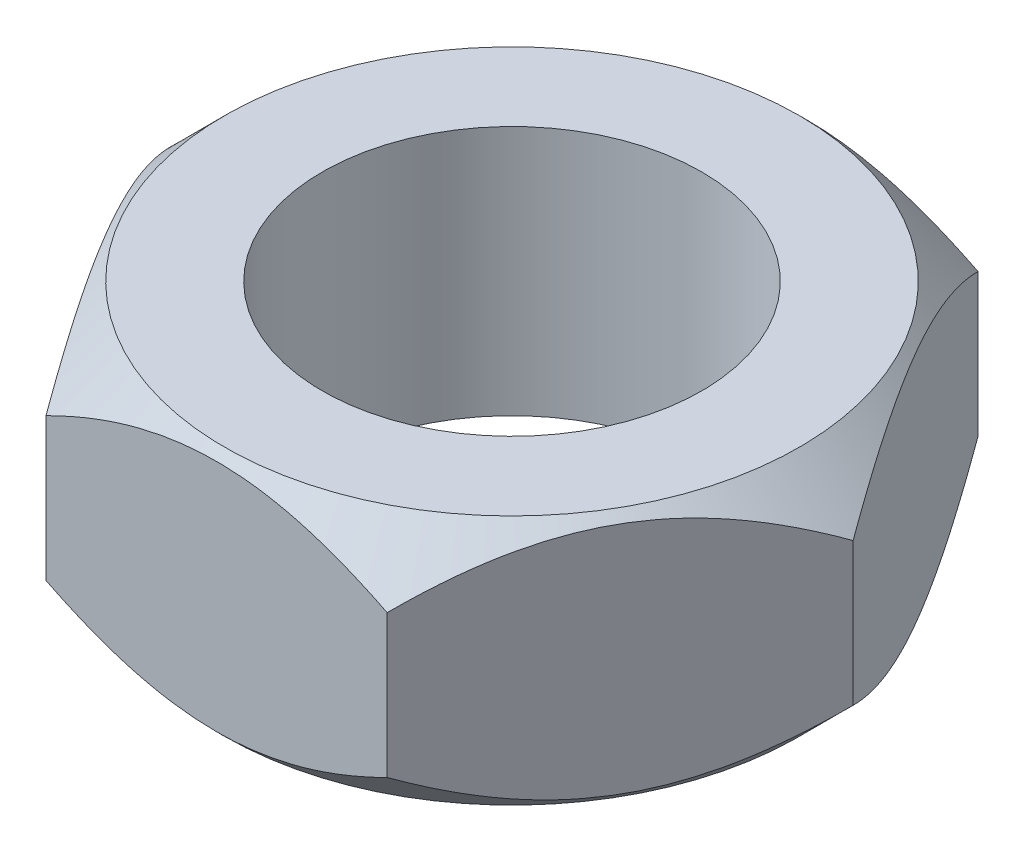
ISO-10303-21;
HEADER;
FILE_DESCRIPTION(('STEP AP214'),'2;1');
FILE_NAME('part.step','',(''),(''),'','','');
FILE_SCHEMA(('AUTOMOTIVE_DESIGN { 1 0 10303 214 1 1 1 1 }'));
ENDSEC;
DATA;
#1=APPLICATION_CONTEXT('core data for automotive mechanical design processes');
#2=APPLICATION_PROTOCOL_DEFINITION('international standard','automotive_design',2000,#1);
#3=PRODUCT_CONTEXT('',#1,'mechanical');
#4=PRODUCT('Part','Part','',(#3));
#5=PRODUCT_RELATED_PRODUCT_CATEGORY('part','',(#4));
#6=PRODUCT_DEFINITION_FORMATION('','',#4);
#7=PRODUCT_DEFINITION_CONTEXT('part definition',#1,'design');
#8=PRODUCT_DEFINITION('design','',#6,#7);
#9=PRODUCT_DEFINITION_SHAPE('','',#8);
#10=(LENGTH_UNIT() NAMED_UNIT(*) SI_UNIT(.MILLI.,.METRE.));
#11=(NAMED_UNIT(*) PLANE_ANGLE_UNIT() SI_UNIT($,.RADIAN.));
#12=(NAMED_UNIT(*) SI_UNIT($,.STERADIAN.) SOLID_ANGLE_UNIT());
#13=UNCERTAINTY_MEASURE_WITH_UNIT(LENGTH_MEASURE(1.E-05),#10,'distance_accuracy_value','');
#14=(GEOMETRIC_REPRESENTATION_CONTEXT(3) GLOBAL_UNCERTAINTY_ASSIGNED_CONTEXT((#13)) GLOBAL_UNIT_ASSIGNED_CONTEXT((#10,
#11,#12)) REPRESENTATION_CONTEXT('',''));
#15=CARTESIAN_POINT('',(0.,0.,0.));
#16=DIRECTION('',(0.,0.,1.));
#17=DIRECTION('',(1.,0.,0.));
#18=AXIS2_PLACEMENT_3D('',#15,#16,#17);
#19=CARTESIAN_POINT('',(-3.146558967083,-1.155,0.));
#20=DIRECTION('',(-0.866025403784429,0.,0.500000000000017));
#21=DIRECTION('',(0.500000000000017,0.,0.866025403784429));
#22=AXIS2_PLACEMENT_3D('',#19,#20,#21);
#23=PLANE('',#22);
#24=DIRECTION('',(0.,1.,0.));
#25=VECTOR('',#24,1.);
#26=CARTESIAN_POINT('',(-3.1465589670836,-1.155,-3.46077333457373E-13));
#27=LINE('',#26,#25);
#28=CARTESIAN_POINT('',(-3.14655896707214,-0.658441032927697,-3.46553808313703E-13));
#29=VERTEX_POINT('',#28);
#30=CARTESIAN_POINT('',(-3.1465589670458,0.658441032987706,-2.5955800009303E-13));
#31=VERTEX_POINT('',#30);
#32=EDGE_CURVE('E66',#29,#31,#27,.T.);
#33=ORIENTED_EDGE('',*,*,#32,.F.);
#34=CARTESIAN_POINT('',(-1.57327945331683,-0.658441012427145,2.72499999109319));
#35=CARTESIAN_POINT('',(-1.62735385239027,-0.712463511504867,2.63134042372436));
#36=CARTESIAN_POINT('',(-1.68233236745095,-0.763312649803809,2.53611485843792));
#37=CARTESIAN_POINT('',(-1.79443919356417,-0.856415247419813,2.34194015160598));
#38=CARTESIAN_POINT('',(-1.85157816010719,-0.898616921399755,2.24297255409038));
#39=CARTESIAN_POINT('',(-1.96679608550521,-0.970908674064697,2.04340925021979));
#40=CARTESIAN_POINT('',(-2.02484571760728,-1.00118040629667,1.94286433920303));
#41=CARTESIAN_POINT('',(-2.1422225889373,-1.04781977573607,1.73956163524897));
#42=CARTESIAN_POINT('',(-2.20154624505079,-1.06422221440778,1.63681004845166));
#43=CARTESIAN_POINT('',(-2.30379329945503,-1.07902183705712,1.45971295513974));
#44=CARTESIAN_POINT('',(-2.34658469645409,-1.08121199897815,1.38559608145922));
#45=CARTESIAN_POINT('',(-2.43209747681233,-1.0775174757251,1.23748360121796));
#46=CARTESIAN_POINT('',(-2.47481883037726,-1.07162996024797,1.16348804626234));
#47=CARTESIAN_POINT('',(-2.55985807644768,-1.05211512513995,1.01619575142145));
#48=CARTESIAN_POINT('',(-2.60217546398526,-1.03847915202545,0.942899886166263));
#49=CARTESIAN_POINT('',(-2.68607844447894,-1.00421588671783,0.797575661047367));
#50=CARTESIAN_POINT('',(-2.72766409330045,-0.98358913070146,0.725547204421909));
#51=CARTESIAN_POINT('',(-2.83415794707125,-0.922368950855765,0.541094438996017));
#52=CARTESIAN_POINT('',(-2.8984065063728,-0.877165919070921,0.429812669973157));
#53=CARTESIAN_POINT('',(-2.99287907409904,-0.800859207027351,0.266181382750029));
#54=CARTESIAN_POINT('',(-3.02401210325186,-0.774048882005916,0.212257394463787));
#55=CARTESIAN_POINT('',(-3.08570170243379,-0.717984626679821,0.105407874382059));
#56=CARTESIAN_POINT('',(-3.11625861186847,-0.688732193962036,0.0524817547188895));
#57=CARTESIAN_POINT('',(-3.14655896707145,-0.658441032928387,2.00064182113546E-11));
#58=B_SPLINE_CURVE_WITH_KNOTS('',3,(#34,#35,#36,#37,#38,#39,#40,#41,#42,#43,#44,#45,#46,#47,#48,
#49,#50,#51,#52,#53,#54,#55,#56,#57),.UNSPECIFIED.,.F.,.F.,(4,2,2,2,2,2,2,2,2,2,2,4),(0.,
0.3629235291882,0.727960699415639,1.08720231310797,1.44553980350415,1.70200873386024,
1.95856755022813,2.21541345640569,2.47223966755772,2.88003269396678,3.08337606552174,
3.28659564302241),.UNSPECIFIED.);
#59=CARTESIAN_POINT('',(-1.57327944817806,-0.658441050598211,2.725));
#60=VERTEX_POINT('',#59);
#61=EDGE_CURVE('E95',#60,#29,#58,.T.);
#62=ORIENTED_EDGE('',*,*,#61,.F.);
#63=DIRECTION('',(0.,1.,0.));
#64=VECTOR('',#63,1.);
#65=CARTESIAN_POINT('',(-1.573279483542,-1.155,2.725));
#66=LINE('',#65,#64);
#67=CARTESIAN_POINT('',(-1.57327950121561,0.658441050590453,2.72499996938771));
#68=VERTEX_POINT('',#67);
#69=EDGE_CURVE('E266',#68,#60,#66,.F.);
#70=ORIENTED_EDGE('',*,*,#69,.F.);
#71=CARTESIAN_POINT('',(-3.1465589670602,0.658441032922622,1.54283671061998E-11));
#72=CARTESIAN_POINT('',(-3.09248458289511,0.712463522984266,0.0936595807927665));
#73=CARTESIAN_POINT('',(-3.037506073913,0.763312657371978,0.188885151680485));
#74=CARTESIAN_POINT('',(-2.92539925207678,0.856415251678163,0.383059862980547));
#75=CARTESIAN_POINT('',(-2.86826028368363,0.898616926270955,0.482027459327832));
#76=CARTESIAN_POINT('',(-2.75304235657708,0.970908678851995,0.681590763017903));
#77=CARTESIAN_POINT('',(-2.69499272457821,1.00118041037951,0.782135675001068));
#78=CARTESIAN_POINT('',(-2.57761585295421,1.04781977848089,0.985438380287633));
#79=CARTESIAN_POINT('',(-2.51829219644593,1.06422221652869,1.08818996745061));
#80=CARTESIAN_POINT('',(-2.41604514151008,1.07902183788081,1.26528706152373));
#81=CARTESIAN_POINT('',(-2.3732537443201,1.08121199918666,1.33940393558364));
#82=CARTESIAN_POINT('',(-2.28774096357217,1.07751747464914,1.48751641653556));
#83=CARTESIAN_POINT('',(-2.24501960980848,1.07162995849985,1.56151197182238));
#84=CARTESIAN_POINT('',(-2.15998036343147,1.05211512202536,1.70880426718473));
#85=CARTESIAN_POINT('',(-2.11766297578553,1.03847914822611,1.78210013263109));
#86=CARTESIAN_POINT('',(-2.033759995103,1.00421588157492,1.92742435807969));
#87=CARTESIAN_POINT('',(-1.99217434620089,0.983589124900726,1.99945281484387));
#88=CARTESIAN_POINT('',(-1.88568050072031,0.922368948284322,2.18390556590961));
#89=CARTESIAN_POINT('',(-1.82143194952036,0.87716592240352,2.29518732090061));
#90=CARTESIAN_POINT('',(-1.72695939344209,0.800859221152326,2.45881858794906));
#91=CARTESIAN_POINT('',(-1.69582636807044,0.774048900031499,2.51274256968609));
#92=CARTESIAN_POINT('',(-1.63413677630698,0.717984653012607,2.61959207691859));
#93=CARTESIAN_POINT('',(-1.60357987050984,0.68873222470037,2.67251819028132));
#94=CARTESIAN_POINT('',(-1.57327951888923,0.658441068264666,2.72499993877542));
#95=B_SPLINE_CURVE_WITH_KNOTS('',3,(#71,#72,#73,#74,#75,#76,#77,#78,#79,#80,#81,#82,#83,#84,#85,
#86,#87,#88,#89,#90,#91,#92,#93,#94),.UNSPECIFIED.,.F.,.F.,(4,2,2,2,2,2,2,2,2,2,2,4),(0.,
0.362923529223738,0.727960700078435,1.08720231534865,1.44553980706256,1.70200873862328,
1.95856755628646,2.21541346344254,2.47223967553623,2.8800326505527,3.08337599664991,
3.28659554876897),.UNSPECIFIED.);
#96=EDGE_CURVE('E96',#31,#68,#95,.T.);
#97=ORIENTED_EDGE('',*,*,#96,.F.);
#98=EDGE_LOOP('',(#33,#62,#70,#97));
#99=FACE_BOUND('',#98,.T.);
#100=ADVANCED_FACE('F40',(#99),#23,.T.);
#101=CARTESIAN_POINT('',(-1.573279483542,-1.155,2.725));
#102=DIRECTION('',(0.,0.,1.));
#103=DIRECTION('',(1.,0.,0.));
#104=AXIS2_PLACEMENT_3D('',#101,#102,#103);
#105=PLANE('',#104);
#106=ORIENTED_EDGE('',*,*,#69,.T.);
#107=CARTESIAN_POINT('',(1.57327949095174,-0.658441012418716,2.72499996936699));
#108=CARTESIAN_POINT('',(1.46513072682617,-0.712463511468376,2.72499998897745));
#109=CARTESIAN_POINT('',(1.35517371073004,-0.763312649741841,2.72499999704032));
#110=CARTESIAN_POINT('',(1.13096006891223,-0.856415247317498,2.72500000297692));
#111=CARTESIAN_POINT('',(1.01668213210636,-0.898616921282592,2.72500000079104));
#112=CARTESIAN_POINT('',(0.786246278598588,-0.970908673973942,2.72499999922152));
#113=CARTESIAN_POINT('',(0.670147015322371,-1.00118040623445,2.72499999979396));
#114=CARTESIAN_POINT('',(0.435393273244714,-1.04781977571625,2.72500000020552));
#115=CARTESIAN_POINT('',(0.316745960675414,-1.06422221440192,2.7250000000465));
#116=CARTESIAN_POINT('',(0.112251851637851,-1.07902183705822,2.72499999996672));
#117=CARTESIAN_POINT('',(0.0266690576583329,-1.08121199897888,2.72499999999108));
#118=CARTESIAN_POINT('',(-0.144356503074575,-1.07751747572065,2.72500000000892));
#119=CARTESIAN_POINT('',(-0.229799210239503,-1.07162996023867,2.72500000000239));
#120=CARTESIAN_POINT('',(-0.3998777023883,-1.05211512512237,2.7249999999976));
#121=CARTESIAN_POINT('',(-0.484512477436847,-1.03847915200869,2.72499999999935));
#122=CARTESIAN_POINT('',(-0.652318438375322,-1.00421588670668,2.72500000000065));
#123=CARTESIAN_POINT('',(-0.73548973599611,-0.983589130695199,2.72500000000021));
#124=CARTESIAN_POINT('',(-0.948477430812854,-0.922368954507613,2.72499999999967));
#125=CARTESIAN_POINT('',(-1.07697453713414,-0.877165927859937,2.72499999999993));
#126=CARTESIAN_POINT('',(-1.26591965490603,-0.800859224908847,2.72500000000003));
#127=CARTESIAN_POINT('',(-1.32818570745618,-0.774048903140395,2.72500000000002));
#128=CARTESIAN_POINT('',(-1.45156489452842,-0.717984654677921,2.72499999999998));
#129=CARTESIAN_POINT('',(-1.51267870786125,-0.688732225569928,2.72499999999997));
#130=CARTESIAN_POINT('',(-1.57327941281299,-0.658441068280744,2.725));
#131=B_SPLINE_CURVE_WITH_KNOTS('',3,(#107,#108,#109,#110,#111,#112,#113,#114,#115,#116,#117,
#118,#119,#120,#121,#122,#123,#124,#125,#126,#127,#128,#129,#130),.UNSPECIFIED.,.F.,.F.,(4,2,2,
2,2,2,2,2,2,2,2,4),(0.,0.362923528988481,0.727960699016619,1.08720231291371,1.44553980351279,
1.70200873393932,1.9585675503788,2.21541345648712,2.47223966756621,2.88003265434725,
3.08337600618884,3.28659556403955),.UNSPECIFIED.);
#132=CARTESIAN_POINT('',(1.57327950122693,-0.658441050601167,2.72499996936881));
#133=VERTEX_POINT('',#132);
#134=EDGE_CURVE('E109',#133,#60,#131,.T.);
#135=ORIENTED_EDGE('',*,*,#134,.F.);
#136=DIRECTION('',(0.,1.,0.));
#137=VECTOR('',#136,1.);
#138=CARTESIAN_POINT('',(1.573279483542,-1.155,2.725));
#139=LINE('',#138,#137);
#140=CARTESIAN_POINT('',(1.57327944819326,0.658441050590608,2.725));
#141=VERTEX_POINT('',#140);
#142=EDGE_CURVE('E262',#141,#133,#139,.F.);
#143=ORIENTED_EDGE('',*,*,#142,.F.);
#144=CARTESIAN_POINT('',(-1.57327949096693,0.658441012422445,2.72499996938765));
#145=CARTESIAN_POINT('',(-1.46513072683729,0.712463511467171,2.72499998898488));
#146=CARTESIAN_POINT('',(-1.35517371073863,0.763312649739124,2.72499999704231));
#147=CARTESIAN_POINT('',(-1.13096006891692,0.856415247314693,2.72500000297491));
#148=CARTESIAN_POINT('',(-1.01668213210969,0.898616921281214,2.7250000007905));
#149=CARTESIAN_POINT('',(-0.786246278598659,0.970908673974249,2.72499999922205));
#150=CARTESIAN_POINT('',(-0.67014701532056,1.00118040623503,2.7249999997941));
#151=CARTESIAN_POINT('',(-0.435393273239236,1.04781977571713,2.72500000020539));
#152=CARTESIAN_POINT('',(-0.316745960668151,1.06422221440283,2.72500000004647));
#153=CARTESIAN_POINT('',(-0.112251851628469,1.07902183705862,2.72499999996674));
#154=CARTESIAN_POINT('',(-0.0266690576486264,1.08121199897899,2.72499999999109));
#155=CARTESIAN_POINT('',(0.144356503084916,1.07751747572011,2.72500000000892));
#156=CARTESIAN_POINT('',(0.229799210250155,1.07162996023778,2.72500000000239));
#157=CARTESIAN_POINT('',(0.399877702399509,1.05211512512075,2.7249999999976));
#158=CARTESIAN_POINT('',(0.484512477448305,1.03847915200669,2.72499999999935));
#159=CARTESIAN_POINT('',(0.652318438387239,1.00421588670391,2.72500000000065));
#160=CARTESIAN_POINT('',(0.735489736008238,0.983589130692039,2.72500000000021));
#161=CARTESIAN_POINT('',(0.948477430828615,0.922368954502563,2.72499999999967));
#162=CARTESIAN_POINT('',(1.0769745371532,0.877165927853025,2.72499999999993));
#163=CARTESIAN_POINT('',(1.26591965492988,0.800859224898823,2.72500000000003));
#164=CARTESIAN_POINT('',(1.3281857074816,0.774048903129276,2.72500000000002));
#165=CARTESIAN_POINT('',(1.45156489455694,0.71798465466453,2.72499999999998));
#166=CARTESIAN_POINT('',(1.51267870789129,0.688732225555363,2.72499999999997));
#167=CARTESIAN_POINT('',(1.57327941284453,0.658441068264976,2.725));
#168=B_SPLINE_CURVE_WITH_KNOTS('',3,(#144,#145,#146,#147,#148,#149,#150,#151,#152,#153,#154,
#155,#156,#157,#158,#159,#160,#161,#162,#163,#164,#165,#166,#167),.UNSPECIFIED.,.F.,.F.,(4,2,2,
2,2,2,2,2,2,2,2,4),(0.,0.362923528993459,0.727960699027081,1.08720231292971,1.4455398035341,
1.70200873396156,1.95856755040205,2.21541345651129,2.47223966759127,2.88003265438345,
3.0833760062307,3.28659556408703),.UNSPECIFIED.);
#169=EDGE_CURVE('E227',#68,#141,#168,.T.);
#170=ORIENTED_EDGE('',*,*,#169,.F.);
#171=EDGE_LOOP('',(#106,#135,#143,#170));
#172=FACE_BOUND('',#171,.T.);
#173=ADVANCED_FACE('F236',(#172),#105,.T.);
#174=CARTESIAN_POINT('',(1.573279483542,-1.155,2.725));
#175=DIRECTION('',(0.866025403784429,0.,0.500000000000017));
#176=DIRECTION('',(0.500000000000017,0.,-0.866025403784429));
#177=AXIS2_PLACEMENT_3D('',#174,#175,#176);
#178=PLANE('',#177);
#179=ORIENTED_EDGE('',*,*,#142,.T.);
#180=CARTESIAN_POINT('',(3.14655896707234,-0.658441032927497,1.98510802809656E-11));
#181=CARTESIAN_POINT('',(3.09248458289961,-0.712463522985868,0.0936595807950094));
#182=CARTESIAN_POINT('',(3.03750607391426,-0.763312657372308,0.188885151682024));
#183=CARTESIAN_POINT('',(2.92539925207536,-0.8564152516777,0.383059862982058));
#184=CARTESIAN_POINT('',(2.8682602836828,-0.898616926270973,0.482027459330029));
#185=CARTESIAN_POINT('',(2.7530423565763,-0.970908678852422,0.68159076302126));
#186=CARTESIAN_POINT('',(2.69499272457689,-1.00118041037986,0.782135675004909));
#187=CARTESIAN_POINT('',(2.5776158529521,-1.04781977848103,0.985438380292513));
#188=CARTESIAN_POINT('',(2.51829219644357,-1.0642222165287,1.08818996745605));
#189=CARTESIAN_POINT('',(2.41604514150734,-1.0790218378804,1.26528706152989));
#190=CARTESIAN_POINT('',(2.37325374431725,-1.08121199918604,1.33940393558997));
#191=CARTESIAN_POINT('',(2.28774096356911,-1.07751747464806,1.48751641654224));
#192=CARTESIAN_POINT('',(2.24501960980533,-1.07162995849853,1.56151197182924));
#193=CARTESIAN_POINT('',(2.15998036342816,-1.05211512202354,1.70880426719186));
#194=CARTESIAN_POINT('',(2.11766297578215,-1.03847914822404,1.78210013263832));
#195=CARTESIAN_POINT('',(2.03375999509952,-1.00421588157235,1.92742435808711));
#196=CARTESIAN_POINT('',(1.99217434619736,-0.983589124897904,1.99945281485137));
#197=CARTESIAN_POINT('',(1.88568050072152,-0.922368948283664,2.18390556590891));
#198=CARTESIAN_POINT('',(1.82143194952619,-0.877165922406416,2.29518732089189));
#199=CARTESIAN_POINT('',(1.72695939345458,-0.800859221161639,2.45881858792882));
#200=CARTESIAN_POINT('',(1.69582636808509,-0.774048900043122,2.5127425696621));
#201=CARTESIAN_POINT('',(1.63413677632586,-0.71798465302913,2.61959207688726));
#202=CARTESIAN_POINT('',(1.6035798705308,-0.688732224719484,2.67251819024639));
#203=CARTESIAN_POINT('',(1.57327951891224,-0.658441068286478,2.72499993873695));
#204=B_SPLINE_CURVE_WITH_KNOTS('',3,(#180,#181,#182,#183,#184,#185,#186,#187,#188,#189,#190,
#191,#192,#193,#194,#195,#196,#197,#198,#199,#200,#201,#202,#203),.UNSPECIFIED.,.F.,.F.,(4,2,2,
2,2,2,2,2,2,2,2,4),(0.,0.362923529224908,0.727960700081032,1.08720231535311,1.44553980706877,
1.70200873863009,1.95856755629392,2.21541346345047,2.47223967554462,2.88003265053155,
3.08337599661412,3.28659554871858),.UNSPECIFIED.);
#205=CARTESIAN_POINT('',(3.14655896706454,-0.658441032935298,0.));
#206=VERTEX_POINT('',#205);
#207=EDGE_CURVE('E240',#206,#133,#204,.T.);
#208=ORIENTED_EDGE('',*,*,#207,.F.);
#209=DIRECTION('',(0.,1.,0.));
#210=VECTOR('',#209,1.);
#211=CARTESIAN_POINT('',(3.146558967083,-1.155,0.));
#212=LINE('',#211,#210);
#213=CARTESIAN_POINT('',(3.14655896703612,0.65844103296372,0.));
#214=VERTEX_POINT('',#213);
#215=EDGE_CURVE('E259',#214,#206,#212,.F.);
#216=ORIENTED_EDGE('',*,*,#215,.F.);
#217=CARTESIAN_POINT('',(1.57327945331725,0.65844101242139,2.72499999112511));
#218=CARTESIAN_POINT('',(1.62735385238402,0.712463511496243,2.63134042374781));
#219=CARTESIAN_POINT('',(1.68233236744258,0.763312649794891,2.53611485845683));
#220=CARTESIAN_POINT('',(1.79443919355565,0.856415247412452,2.34194015161909));
#221=CARTESIAN_POINT('',(1.85157816010068,0.898616921394245,2.24297255410225));
#222=CARTESIAN_POINT('',(1.96679608550172,0.970908674061851,2.04340925022802));
#223=CARTESIAN_POINT('',(2.02484571760482,1.00118040629464,1.94286433920889));
#224=CARTESIAN_POINT('',(2.14222258893723,1.04781977573525,1.73956163525027));
#225=CARTESIAN_POINT('',(2.20154624505207,1.06422221440736,1.63681004845078));
#226=CARTESIAN_POINT('',(2.3037932994578,1.07902183705663,1.45971295513636));
#227=CARTESIAN_POINT('',(2.34658469645702,1.08121199897751,1.38559608145555));
#228=CARTESIAN_POINT('',(2.43209747681557,1.07751747572413,1.23748360121373));
#229=CARTESIAN_POINT('',(2.47481883038067,1.07162996024681,1.16348804625782));
#230=CARTESIAN_POINT('',(2.55985807645138,1.05211512513837,1.01619575141643));
#231=CARTESIAN_POINT('',(2.60217546398909,1.03847915202364,0.942899886161024));
#232=CARTESIAN_POINT('',(2.68607844448301,1.00421588671555,0.797575661041702));
#233=CARTESIAN_POINT('',(2.72766409330464,0.983589130698926,0.725547204416044));
#234=CARTESIAN_POINT('',(2.83415794707492,0.922368950853033,0.541094438991042));
#235=CARTESIAN_POINT('',(2.89840650637586,0.87716591906842,0.429812669969238));
#236=CARTESIAN_POINT('',(2.99287907410124,0.800859207025362,0.266181382747601));
#237=CARTESIAN_POINT('',(3.02401210325379,0.774048882004117,0.212257394461825));
#238=CARTESIAN_POINT('',(3.08570170243519,0.717984626678445,0.105407874381013));
#239=CARTESIAN_POINT('',(3.11625861186961,0.688732193960894,0.0524817547182922));
#240=CARTESIAN_POINT('',(3.14655896707234,0.658441032927497,1.98511627013462E-11));
#241=B_SPLINE_CURVE_WITH_KNOTS('',3,(#217,#218,#219,#220,#221,#222,#223,#224,#225,#226,#227,
#228,#229,#230,#231,#232,#233,#234,#235,#236,#237,#238,#239,#240),.UNSPECIFIED.,.F.,.F.,(4,2,2,
2,2,2,2,2,2,2,2,4),(0.,0.36292352919563,0.727960699430965,1.08720231313126,1.4455398035352,
1.70200873389224,1.95856755026114,2.21541345643957,2.47223966759245,2.88003269399786,
3.08337606555111,3.28659564305008),.UNSPECIFIED.);
#242=EDGE_CURVE('E220',#141,#214,#241,.T.);
#243=ORIENTED_EDGE('',*,*,#242,.F.);
#244=EDGE_LOOP('',(#179,#208,#216,#243));
#245=FACE_BOUND('',#244,.T.);
#246=ADVANCED_FACE('F233',(#245),#178,.T.);
#247=CARTESIAN_POINT('',(3.146558967083,-1.155,0.));
#248=DIRECTION('',(0.866025403784429,0.,-0.500000000000017));
#249=DIRECTION('',(-0.500000000000017,0.,-0.866025403784429));
#250=AXIS2_PLACEMENT_3D('',#247,#248,#249);
#251=PLANE('',#250);
#252=ORIENTED_EDGE('',*,*,#215,.T.);
#253=CARTESIAN_POINT('',(1.57327945330578,-0.658441012417733,-2.72499999110201));
#254=CARTESIAN_POINT('',(1.62735385238208,-0.712463511497627,-2.63134042373483));
#255=CARTESIAN_POINT('',(1.68233236744414,-0.763312649797872,-2.53611485844872));
#256=CARTESIAN_POINT('',(1.79443919355884,-0.856415247415665,-2.34194015161623));
#257=CARTESIAN_POINT('',(1.85157816010193,-0.898616921396089,-2.24297255409975));
#258=CARTESIAN_POINT('',(1.96679608550048,-0.970908674062093,-2.04340925022771));
#259=CARTESIAN_POINT('',(2.02484571760299,-1.00118040629465,-1.94286433921038));
#260=CARTESIAN_POINT('',(2.14222258893384,-1.04781977573501,-1.73956163525503));
#261=CARTESIAN_POINT('',(2.20154624504772,-1.06422221440711,-1.636810048457));
#262=CARTESIAN_POINT('',(2.30379329945234,-1.0790218370569,-1.45971295514438));
#263=CARTESIAN_POINT('',(2.3465846964514,-1.08121199897809,-1.38559608146389));
#264=CARTESIAN_POINT('',(2.43209747680962,-1.07751747572539,-1.23748360122267));
#265=CARTESIAN_POINT('',(2.47481883037454,-1.07162996024843,-1.16348804626706));
#266=CARTESIAN_POINT('',(2.55985807644495,-1.05211512514074,-1.01619575142618));
#267=CARTESIAN_POINT('',(2.60217546398253,-1.03847915202641,-0.942899886170995));
#268=CARTESIAN_POINT('',(2.68607844447622,-1.0042158867191,-0.797575661052083));
#269=CARTESIAN_POINT('',(2.72766409329774,-0.983589130702878,-0.725547204426614));
#270=CARTESIAN_POINT('',(2.8341579470691,-0.922368950857226,-0.54109443899973));
#271=CARTESIAN_POINT('',(2.8984065063712,-0.877165919072134,-0.42981266997592));
#272=CARTESIAN_POINT('',(2.99287907409823,-0.800859207028039,-0.266181382751423));
#273=CARTESIAN_POINT('',(3.02401210325131,-0.774048882006404,-0.212257394464735));
#274=CARTESIAN_POINT('',(3.08570170243375,-0.717984626679868,-0.105407874382132));
#275=CARTESIAN_POINT('',(3.11625861186867,-0.688732193961842,-0.0524817547185326));
#276=CARTESIAN_POINT('',(3.1465589670719,-0.658441032927937,-1.92272678334466E-11));
#277=B_SPLINE_CURVE_WITH_KNOTS('',3,(#253,#254,#255,#256,#257,#258,#259,#260,#261,#262,#263,
#264,#265,#266,#267,#268,#269,#270,#271,#272,#273,#274,#275,#276),.UNSPECIFIED.,.F.,.F.,(4,2,2,
2,2,2,2,2,2,2,2,4),(0.,0.362923529190951,0.727960699421106,1.08720231311598,1.44553980351471,
1.70200873387072,1.95856755023853,2.21541345641601,2.47223966756798,2.88003269398036,
3.08337606553698,3.2865956430393),.UNSPECIFIED.);
#278=CARTESIAN_POINT('',(1.57327944817091,-0.658441050601786,-2.725));
#279=VERTEX_POINT('',#278);
#280=EDGE_CURVE('E120',#279,#206,#277,.T.);
#281=ORIENTED_EDGE('',*,*,#280,.F.);
#282=DIRECTION('',(0.,1.,0.));
#283=VECTOR('',#282,1.);
#284=CARTESIAN_POINT('',(1.573279483542,-1.155,-2.725));
#285=LINE('',#284,#283);
#286=CARTESIAN_POINT('',(1.57327950121561,0.658441050590453,-2.72499996938771));
#287=VERTEX_POINT('',#286);
#288=EDGE_CURVE('E99',#287,#279,#285,.F.);
#289=ORIENTED_EDGE('',*,*,#288,.F.);
#290=CARTESIAN_POINT('',(3.1465589670719,0.658441032927937,-1.92273957850329E-11));
#291=CARTESIAN_POINT('',(3.09248458289915,0.712463522986353,-0.0936595807944324));
#292=CARTESIAN_POINT('',(3.03750607391376,0.763312657372836,-0.188885151681495));
#293=CARTESIAN_POINT('',(2.92539925207481,0.856415251678306,-0.383059862981631));
#294=CARTESIAN_POINT('',(2.86826028368222,0.898616926271615,-0.482027459329655));
#295=CARTESIAN_POINT('',(2.75304235657569,0.970908678853091,-0.681590763020926));
#296=CARTESIAN_POINT('',(2.69499272457629,1.00118041038053,-0.782135675004558));
#297=CARTESIAN_POINT('',(2.57761585295153,1.04781977848171,-0.985438380292129));
#298=CARTESIAN_POINT('',(2.518292196443,1.06422221652938,-1.08818996745565));
#299=CARTESIAN_POINT('',(2.4160451415068,1.07902183788109,-1.26528706152944));
#300=CARTESIAN_POINT('',(2.37325374431673,1.08121199918673,-1.33940393558949));
#301=CARTESIAN_POINT('',(2.28774096356862,1.07751747464877,-1.48751641654171));
#302=CARTESIAN_POINT('',(2.24501960980485,1.07162995849924,-1.56151197182867));
#303=CARTESIAN_POINT('',(2.1599803634277,1.05211512202427,-1.70880426719126));
#304=CARTESIAN_POINT('',(2.1176629757817,1.03847914822477,-1.78210013263771));
#305=CARTESIAN_POINT('',(2.03375999509907,1.00421588157309,-1.9274243580865));
#306=CARTESIAN_POINT('',(1.99217434619691,0.983589124898652,-1.99945281485076));
#307=CARTESIAN_POINT('',(1.88568050071702,0.922368948282089,-2.18390556591531));
#308=CARTESIAN_POINT('',(1.82143194951777,0.877165922401565,-2.29518732090509));
#309=CARTESIAN_POINT('',(1.72695939344051,0.800859221150984,-2.45881858795179));
#310=CARTESIAN_POINT('',(1.69582636806919,0.774048900030389,-2.51274256968826));
#311=CARTESIAN_POINT('',(1.63413677630636,0.717984653012015,-2.61959207691966));
#312=CARTESIAN_POINT('',(1.60357987050953,0.688732224700064,-2.67251819028185));
#313=CARTESIAN_POINT('',(1.57327951888923,0.658441068264666,-2.72499993877542));
#314=B_SPLINE_CURVE_WITH_KNOTS('',3,(#290,#291,#292,#293,#294,#295,#296,#297,#298,#299,#300,
#301,#302,#303,#304,#305,#306,#307,#308,#309,#310,#311,#312,#313),.UNSPECIFIED.,.F.,.F.,(4,2,2,
2,2,2,2,2,2,2,2,4),(0.,0.362923529225113,0.727960700081445,1.08720231535347,1.44553980706908,
1.7020087386303,1.95856755629402,2.21541346345055,2.47223967554469,2.88003265055692,
3.08337599665207,3.28659554876908),.UNSPECIFIED.);
#315=EDGE_CURVE('E209',#214,#287,#314,.T.);
#316=ORIENTED_EDGE('',*,*,#315,.F.);
#317=EDGE_LOOP('',(#252,#281,#289,#316));
#318=FACE_BOUND('',#317,.T.);
#319=ADVANCED_FACE('F197',(#318),#251,.T.);
#320=CARTESIAN_POINT('',(1.573279483542,-1.155,-2.725));
#321=DIRECTION('',(0.,0.,-1.));
#322=DIRECTION('',(-1.,0.,0.));
#323=AXIS2_PLACEMENT_3D('',#320,#321,#322);
#324=PLANE('',#323);
#325=ORIENTED_EDGE('',*,*,#288,.T.);
#326=CARTESIAN_POINT('',(-1.57327949095174,-0.658441012418716,-2.72499996936699));
#327=CARTESIAN_POINT('',(-1.46513072682619,-0.712463511468369,-2.72499998897745));
#328=CARTESIAN_POINT('',(-1.35517371073007,-0.763312649741829,-2.72499999704032));
#329=CARTESIAN_POINT('',(-1.13096006891228,-0.856415247317478,-2.72500000297692));
#330=CARTESIAN_POINT('',(-1.01668213210643,-0.898616921282569,-2.72500000079104));
#331=CARTESIAN_POINT('',(-0.786246278598653,-0.970908673973925,-2.72499999922152));
#332=CARTESIAN_POINT('',(-0.670147015322422,-1.00118040623444,-2.72499999979396));
#333=CARTESIAN_POINT('',(-0.43539327324474,-1.04781977571625,-2.72500000020552));
#334=CARTESIAN_POINT('',(-0.316745960675427,-1.06422221440192,-2.7250000000465));
#335=CARTESIAN_POINT('',(-0.112251851637847,-1.07902183705822,-2.72499999996672));
#336=CARTESIAN_POINT('',(-0.026669057658324,-1.08121199897888,-2.72499999999108));
#337=CARTESIAN_POINT('',(0.144356503074593,-1.07751747572065,-2.72500000000892));
#338=CARTESIAN_POINT('',(0.229799210239526,-1.07162996023867,-2.72500000000239));
#339=CARTESIAN_POINT('',(0.399877702388323,-1.05211512512237,-2.7249999999976));
#340=CARTESIAN_POINT('',(0.484512477436865,-1.03847915200869,-2.72499999999935));
#341=CARTESIAN_POINT('',(0.652318438375331,-1.00421588670668,-2.72500000000065));
#342=CARTESIAN_POINT('',(0.735489735996115,-0.983589130695198,-2.72500000000021));
#343=CARTESIAN_POINT('',(0.948477430810361,-0.922368954508329,-2.72499999999967));
#344=CARTESIAN_POINT('',(1.07697453712923,-0.877165927861661,-2.72499999999993));
#345=CARTESIAN_POINT('',(1.26591965489766,-0.800859224912357,-2.72500000000003));
#346=CARTESIAN_POINT('',(1.32818570744667,-0.774048903144544,-2.72500000000002));
#347=CARTESIAN_POINT('',(1.4515648945167,-0.717984654683417,-2.72499999999998));
#348=CARTESIAN_POINT('',(1.51267870784844,-0.688732225576133,-2.72499999999997));
#349=CARTESIAN_POINT('',(1.57327941279911,-0.658441068287684,-2.725));
#350=B_SPLINE_CURVE_WITH_KNOTS('',3,(#326,#327,#328,#329,#330,#331,#332,#333,#334,#335,#336,
#337,#338,#339,#340,#341,#342,#343,#344,#345,#346,#347,#348,#349),.UNSPECIFIED.,.F.,.F.,(4,2,2,
2,2,2,2,2,2,2,2,4),(0.,0.362923528988442,0.72796069901654,1.08720231291367,1.44553980351279,
1.70200873393933,1.95856755037883,2.21541345648714,2.47223966756621,2.88003265433947,
3.0833760061772,3.28659556402404),.UNSPECIFIED.);
#351=CARTESIAN_POINT('',(-1.57327950122693,-0.658441050601167,-2.72499996936881));
#352=VERTEX_POINT('',#351);
#353=EDGE_CURVE('E116',#352,#279,#350,.T.);
#354=ORIENTED_EDGE('',*,*,#353,.F.);
#355=DIRECTION('',(0.,1.,0.));
#356=VECTOR('',#355,1.);
#357=CARTESIAN_POINT('',(-1.573279483542,-1.155,-2.725));
#358=LINE('',#357,#356);
#359=CARTESIAN_POINT('',(-1.57327944818479,0.658441050594846,-2.725));
#360=VERTEX_POINT('',#359);
#361=EDGE_CURVE('E98',#360,#352,#358,.F.);
#362=ORIENTED_EDGE('',*,*,#361,.F.);
#363=CARTESIAN_POINT('',(1.57327949096693,0.658441012422445,-2.72499996938765));
#364=CARTESIAN_POINT('',(1.46513072683731,0.712463511467164,-2.72499998898488));
#365=CARTESIAN_POINT('',(1.35517371073866,0.763312649739111,-2.72499999704231));
#366=CARTESIAN_POINT('',(1.13096006891698,0.85641524731467,-2.72500000297491));
#367=CARTESIAN_POINT('',(1.01668213210977,0.898616921281187,-2.7250000007905));
#368=CARTESIAN_POINT('',(0.786246278598737,0.970908673974228,-2.72499999922205));
#369=CARTESIAN_POINT('',(0.670147015320623,1.00118040623502,-2.7249999997941));
#370=CARTESIAN_POINT('',(0.435393273239267,1.04781977571712,-2.72500000020539));
#371=CARTESIAN_POINT('',(0.316745960668166,1.06422221440282,-2.72500000004647));
#372=CARTESIAN_POINT('',(0.112251851628464,1.07902183705862,-2.72499999996674));
#373=CARTESIAN_POINT('',(0.0266690576486148,1.08121199897899,-2.72499999999109));
#374=CARTESIAN_POINT('',(-0.144356503084939,1.07751747572011,-2.72500000000892));
#375=CARTESIAN_POINT('',(-0.229799210250183,1.07162996023778,-2.72500000000239));
#376=CARTESIAN_POINT('',(-0.399877702399538,1.05211512512075,-2.7249999999976));
#377=CARTESIAN_POINT('',(-0.484512477448328,1.03847915200668,-2.72499999999935));
#378=CARTESIAN_POINT('',(-0.652318438387251,1.00421588670391,-2.72500000000065));
#379=CARTESIAN_POINT('',(-0.735489736008244,0.983589130692038,-2.72500000000021));
#380=CARTESIAN_POINT('',(-0.94847743082557,0.922368954503438,-2.72499999999967));
#381=CARTESIAN_POINT('',(-1.07697453714721,0.877165927855132,-2.72499999999993));
#382=CARTESIAN_POINT('',(-1.26591965491965,0.80085922490311,-2.72500000000003));
#383=CARTESIAN_POINT('',(-1.32818570747,0.774048903134342,-2.72500000000002));
#384=CARTESIAN_POINT('',(-1.45156489454263,0.717984654671241,-2.72499999999998));
#385=CARTESIAN_POINT('',(-1.51267870787564,0.68873222556294,-2.72499999999997));
#386=CARTESIAN_POINT('',(-1.57327941282758,0.658441068273451,-2.725));
#387=B_SPLINE_CURVE_WITH_KNOTS('',3,(#363,#364,#365,#366,#367,#368,#369,#370,#371,#372,#373,
#374,#375,#376,#377,#378,#379,#380,#381,#382,#383,#384,#385,#386),.UNSPECIFIED.,.F.,.F.,(4,2,2,
2,2,2,2,2,2,2,2,4),(0.,0.362923528993411,0.727960699026984,1.08720231292966,1.4455398035341,
1.70200873396158,1.95856755040208,2.2154134565113,2.47223966759127,2.88003265437395,
3.08337600621647,3.28659556406809),.UNSPECIFIED.);
#388=EDGE_CURVE('E202',#287,#360,#387,.T.);
#389=ORIENTED_EDGE('',*,*,#388,.F.);
#390=EDGE_LOOP('',(#325,#354,#362,#389));
#391=FACE_BOUND('',#390,.T.);
#392=ADVANCED_FACE('F194',(#391),#324,.T.);
#393=CARTESIAN_POINT('',(-1.573279483542,-1.155,-2.725));
#394=DIRECTION('',(-0.866025403784429,0.,-0.500000000000017));
#395=DIRECTION('',(-0.500000000000017,0.,0.866025403784429));
#396=AXIS2_PLACEMENT_3D('',#393,#394,#395);
#397=PLANE('',#396);
#398=ORIENTED_EDGE('',*,*,#361,.T.);
#399=CARTESIAN_POINT('',(-3.14655896706032,-0.658441032922095,-1.60316820807313E-11));
#400=CARTESIAN_POINT('',(-3.09248458289544,-0.712463522983767,-0.0936595807933702));
#401=CARTESIAN_POINT('',(-3.03750607391344,-0.763312657371461,-0.188885151681052));
#402=CARTESIAN_POINT('',(-2.92539925207735,-0.856415251677577,-0.383059862981001));
#403=CARTESIAN_POINT('',(-2.86826028368422,-0.898616926270317,-0.482027459328211));
#404=CARTESIAN_POINT('',(-2.7530423565777,-0.970908678851311,-0.681590763018204));
#405=CARTESIAN_POINT('',(-2.69499272457883,-1.00118041037882,-0.782135675001369));
#406=CARTESIAN_POINT('',(-2.57761585295484,-1.0478197784802,-0.985438380287932));
#407=CARTESIAN_POINT('',(-2.51829219644656,-1.064222216528,-1.08818996745091));
#408=CARTESIAN_POINT('',(-2.41604514151069,-1.07902183788011,-1.26528706152405));
#409=CARTESIAN_POINT('',(-2.3732537443207,-1.08121199918597,-1.33940393558399));
#410=CARTESIAN_POINT('',(-2.28774096357274,-1.07751747464844,-1.48751641653596));
#411=CARTESIAN_POINT('',(-2.24501960980904,-1.07162995849915,-1.56151197182281));
#412=CARTESIAN_POINT('',(-2.15998036343201,-1.05211512202466,-1.70880426718518));
#413=CARTESIAN_POINT('',(-2.11766297578607,-1.03847914822541,-1.78210013263154));
#414=CARTESIAN_POINT('',(-2.03375999510354,-1.00421588157422,-1.92742435808015));
#415=CARTESIAN_POINT('',(-1.99217434620142,-0.983589124900024,-1.99945281484432));
#416=CARTESIAN_POINT('',(-1.88568050072489,-0.922368948285947,-2.18390556590307));
#417=CARTESIAN_POINT('',(-1.82143194952884,-0.877165922408416,-2.29518732088731));
#418=CARTESIAN_POINT('',(-1.72695939345619,-0.800859221163012,-2.45881858792603));
#419=CARTESIAN_POINT('',(-1.69582636808637,-0.774048900044257,-2.51274256965988));
#420=CARTESIAN_POINT('',(-1.63413677632649,-0.717984653029736,-2.61959207688617));
#421=CARTESIAN_POINT('',(-1.60357987053112,-0.688732224719798,-2.67251819024585));
#422=CARTESIAN_POINT('',(-1.57327951891224,-0.658441068286478,-2.72499993873695));
#423=B_SPLINE_CURVE_WITH_KNOTS('',3,(#399,#400,#401,#402,#403,#404,#405,#406,#407,#408,#409,
#410,#411,#412,#413,#414,#415,#416,#417,#418,#419,#420,#421,#422),.UNSPECIFIED.,.F.,.F.,(4,2,2,
2,2,2,2,2,2,2,2,4),(0.,0.362923529223481,0.72796070007791,1.08720231534811,1.44553980706202,
1.70200873862283,1.9585675562861,2.21541346344218,2.47223967553587,2.88003265052714,
3.08337599661182,3.28659554871838),.UNSPECIFIED.);
#424=EDGE_CURVE('E44',#29,#352,#423,.T.);
#425=ORIENTED_EDGE('',*,*,#424,.F.);
#426=ORIENTED_EDGE('',*,*,#32,.T.);
#427=CARTESIAN_POINT('',(-1.57327945330414,0.658441012410233,-2.72499999113557));
#428=CARTESIAN_POINT('',(-1.62735385237431,0.71246351148766,-2.63134042376023));
#429=CARTESIAN_POINT('',(-1.6823323674345,0.763312649787851,-2.53611485846964));
#430=CARTESIAN_POINT('',(-1.79443919354932,0.856415247407531,-2.34194015163125));
#431=CARTESIAN_POINT('',(-1.85157816009444,0.898616921389896,-2.24297255411336));
#432=CARTESIAN_POINT('',(-1.96679608549611,0.970908674058762,-2.04340925023742));
#433=CARTESIAN_POINT('',(-2.02484571759973,1.00118040629225,-1.9428643392176));
#434=CARTESIAN_POINT('',(-2.14222258893313,1.047819775734,-1.73956163525746));
#435=CARTESIAN_POINT('',(-2.20154624504843,1.06422221440656,-1.63681004845711));
#436=CARTESIAN_POINT('',(-2.30379329945462,1.07902183705636,-1.45971295514185));
#437=CARTESIAN_POINT('',(-2.34658469645382,1.08121199897745,-1.38559608146108));
#438=CARTESIAN_POINT('',(-2.43209747681235,1.07751747572447,-1.23748360121931));
#439=CARTESIAN_POINT('',(-2.47481883037744,1.07162996024736,-1.16348804626342));
#440=CARTESIAN_POINT('',(-2.55985807644814,1.05211512513931,-1.01619575142204));
#441=CARTESIAN_POINT('',(-2.60217546398585,1.03847915202478,-0.942899886166629));
#442=CARTESIAN_POINT('',(-2.68607844447978,1.00421588671705,-0.79757566104729));
#443=CARTESIAN_POINT('',(-2.72766409330142,0.983589130700605,-0.725547204421618));
#444=CARTESIAN_POINT('',(-2.83415794707219,0.92236895085487,-0.541094438995764));
#445=CARTESIAN_POINT('',(-2.89840650637361,0.877165919070114,-0.429812669973145));
#446=CARTESIAN_POINT('',(-2.99287907409966,0.8008592070267,-0.266181382750335));
#447=CARTESIAN_POINT('',(-3.02401210325243,0.774048882005313,-0.212257394464176));
#448=CARTESIAN_POINT('',(-3.08570170243427,0.71798462667932,-0.105407874382613));
#449=CARTESIAN_POINT('',(-3.1162586118689,0.68873219396159,-0.0524817547195237));
#450=CARTESIAN_POINT('',(-3.14655896707184,0.658441032927998,-2.07203031577264E-11));
#451=B_SPLINE_CURVE_WITH_KNOTS('',3,(#427,#428,#429,#430,#431,#432,#433,#434,#435,#436,#437,
#438,#439,#440,#441,#442,#443,#444,#445,#446,#447,#448,#449,#450),.UNSPECIFIED.,.F.,.F.,(4,2,2,
2,2,2,2,2,2,2,2,4),(0.,0.362923529198885,0.727960699437434,1.08720231314074,1.44553980354771,
1.70200873390467,1.95856755027347,2.21541345645181,2.47223966760462,2.88003269401281,
3.08337606556744,3.28659564306779),.UNSPECIFIED.);
#452=EDGE_CURVE('E142',#360,#31,#451,.T.);
#453=ORIENTED_EDGE('',*,*,#452,.F.);
#454=EDGE_LOOP('',(#398,#425,#426,#453));
#455=FACE_BOUND('',#454,.T.);
#456=ADVANCED_FACE('F113',(#455),#397,.T.);
#457=CARTESIAN_POINT('',(0.,-0.655461679173186,0.));
#458=DIRECTION('',(0.,1.,0.));
#459=DIRECTION('',(0.,0.,1.));
#460=AXIS2_PLACEMENT_3D('',#457,#458,#459);
#461=CONICAL_SURFACE('',#460,3.14953832082665,0.785398163397448);
#462=CARTESIAN_POINT('',(0.,-1.15500000003976,0.));
#463=DIRECTION('',(0.,1.,0.));
#464=DIRECTION('',(0.,0.,1.));
#465=AXIS2_PLACEMENT_3D('',#462,#463,#464);
#466=CIRCLE('',#465,2.64999999996007);
#467=CARTESIAN_POINT('',(0.,-1.15500000003976,2.64999999996007));
#468=VERTEX_POINT('',#467);
#469=EDGE_CURVE('E57',#468,#468,#466,.T.);
#470=ORIENTED_EDGE('',*,*,#469,.T.);
#471=EDGE_LOOP('',(#470));
#472=FACE_BOUND('',#471,.T.);
#473=ORIENTED_EDGE('',*,*,#61,.T.);
#474=ORIENTED_EDGE('',*,*,#424,.T.);
#475=ORIENTED_EDGE('',*,*,#353,.T.);
#476=ORIENTED_EDGE('',*,*,#280,.T.);
#477=ORIENTED_EDGE('',*,*,#207,.T.);
#478=ORIENTED_EDGE('',*,*,#134,.T.);
#479=EDGE_LOOP('',(#473,#474,#475,#476,#477,#478));
#480=FACE_BOUND('',#479,.T.);
#481=ADVANCED_FACE('F104',(#472,#480),#461,.T.);
#482=CARTESIAN_POINT('',(0.,0.655461679173186,0.));
#483=DIRECTION('',(0.,-1.,0.));
#484=DIRECTION('',(0.,0.,-1.));
#485=AXIS2_PLACEMENT_3D('',#482,#483,#484);
#486=CONICAL_SURFACE('',#485,3.14953832082665,0.785398163397448);
#487=ORIENTED_EDGE('',*,*,#242,.T.);
#488=ORIENTED_EDGE('',*,*,#315,.T.);
#489=ORIENTED_EDGE('',*,*,#388,.T.);
#490=ORIENTED_EDGE('',*,*,#452,.T.);
#491=ORIENTED_EDGE('',*,*,#96,.T.);
#492=ORIENTED_EDGE('',*,*,#169,.T.);
#493=EDGE_LOOP('',(#487,#488,#489,#490,#491,#492));
#494=FACE_BOUND('',#493,.T.);
#495=CARTESIAN_POINT('',(0.,1.15500000003976,0.));
#496=DIRECTION('',(0.,-1.,0.));
#497=DIRECTION('',(0.,0.,-1.));
#498=AXIS2_PLACEMENT_3D('',#495,#496,#497);
#499=CIRCLE('',#498,2.64999999996007);
#500=CARTESIAN_POINT('',(0.,1.15500000003976,-2.64999999996007));
#501=VERTEX_POINT('',#500);
#502=EDGE_CURVE('E12',#501,#501,#499,.F.);
#503=ORIENTED_EDGE('',*,*,#502,.F.);
#504=EDGE_LOOP('',(#503));
#505=FACE_BOUND('',#504,.T.);
#506=ADVANCED_FACE('F172',(#494,#505),#486,.T.);
#507=CARTESIAN_POINT('',(0.,-1.155,0.));
#508=DIRECTION('',(0.,1.,0.));
#509=DIRECTION('',(0.,0.,1.));
#510=AXIS2_PLACEMENT_3D('',#507,#508,#509);
#511=PLANE('',#510);
#512=CARTESIAN_POINT('',(0.,-1.155,0.));
#513=DIRECTION('',(0.,-1.,0.));
#514=DIRECTION('',(0.,0.,-1.));
#515=AXIS2_PLACEMENT_3D('',#512,#513,#514);
#516=CIRCLE('',#515,1.74999999999999);
#517=CARTESIAN_POINT('',(0.,-1.155,-1.74999999999999));
#518=VERTEX_POINT('',#517);
#519=EDGE_CURVE('E273',#518,#518,#516,.T.);
#520=ORIENTED_EDGE('',*,*,#519,.F.);
#521=EDGE_LOOP('',(#520));
#522=FACE_BOUND('',#521,.T.);
#523=ORIENTED_EDGE('',*,*,#469,.F.);
#524=EDGE_LOOP('',(#523));
#525=FACE_BOUND('',#524,.T.);
#526=ADVANCED_FACE('F281',(#522,#525),#511,.F.);
#527=CARTESIAN_POINT('',(0.,1.155,0.));
#528=DIRECTION('',(0.,1.,0.));
#529=DIRECTION('',(0.,0.,1.));
#530=AXIS2_PLACEMENT_3D('',#527,#528,#529);
#531=PLANE('',#530);
#532=CARTESIAN_POINT('',(0.,1.15500000003977,0.));
#533=DIRECTION('',(0.,-1.,0.));
#534=DIRECTION('',(0.,0.,-1.));
#535=AXIS2_PLACEMENT_3D('',#532,#533,#534);
#536=CIRCLE('',#535,1.74999999999999);
#537=CARTESIAN_POINT('',(0.,1.15500000003977,-1.74999999999999));
#538=VERTEX_POINT('',#537);
#539=EDGE_CURVE('E124',#538,#538,#536,.T.);
#540=ORIENTED_EDGE('',*,*,#539,.T.);
#541=EDGE_LOOP('',(#540));
#542=FACE_BOUND('',#541,.T.);
#543=ORIENTED_EDGE('',*,*,#502,.T.);
#544=EDGE_LOOP('',(#543));
#545=FACE_BOUND('',#544,.T.);
#546=ADVANCED_FACE('F284',(#542,#545),#531,.T.);
#547=CARTESIAN_POINT('',(0.,-1.155,0.));
#548=DIRECTION('',(0.,-1.,0.));
#549=DIRECTION('',(0.,0.,-1.));
#550=AXIS2_PLACEMENT_3D('',#547,#548,#549);
#551=CYLINDRICAL_SURFACE('',#550,1.74999999999999);
#552=ORIENTED_EDGE('',*,*,#539,.F.);
#553=EDGE_LOOP('',(#552));
#554=FACE_BOUND('',#553,.T.);
#555=ORIENTED_EDGE('',*,*,#519,.T.);
#556=EDGE_LOOP('',(#555));
#557=FACE_BOUND('',#556,.T.);
#558=ADVANCED_FACE('F279',(#554,#557),#551,.F.);
#559=CLOSED_SHELL('',(#100,#173,#246,#319,#392,#456,#481,#506,#526,#546,#558));
#560=MANIFOLD_SOLID_BREP('B2',#559);
#561=ADVANCED_BREP_SHAPE_REPRESENTATION('',(#18,#560),#14);
#562=SHAPE_DEFINITION_REPRESENTATION(#9,#561);
ENDSEC;
END-ISO-10303-21;
